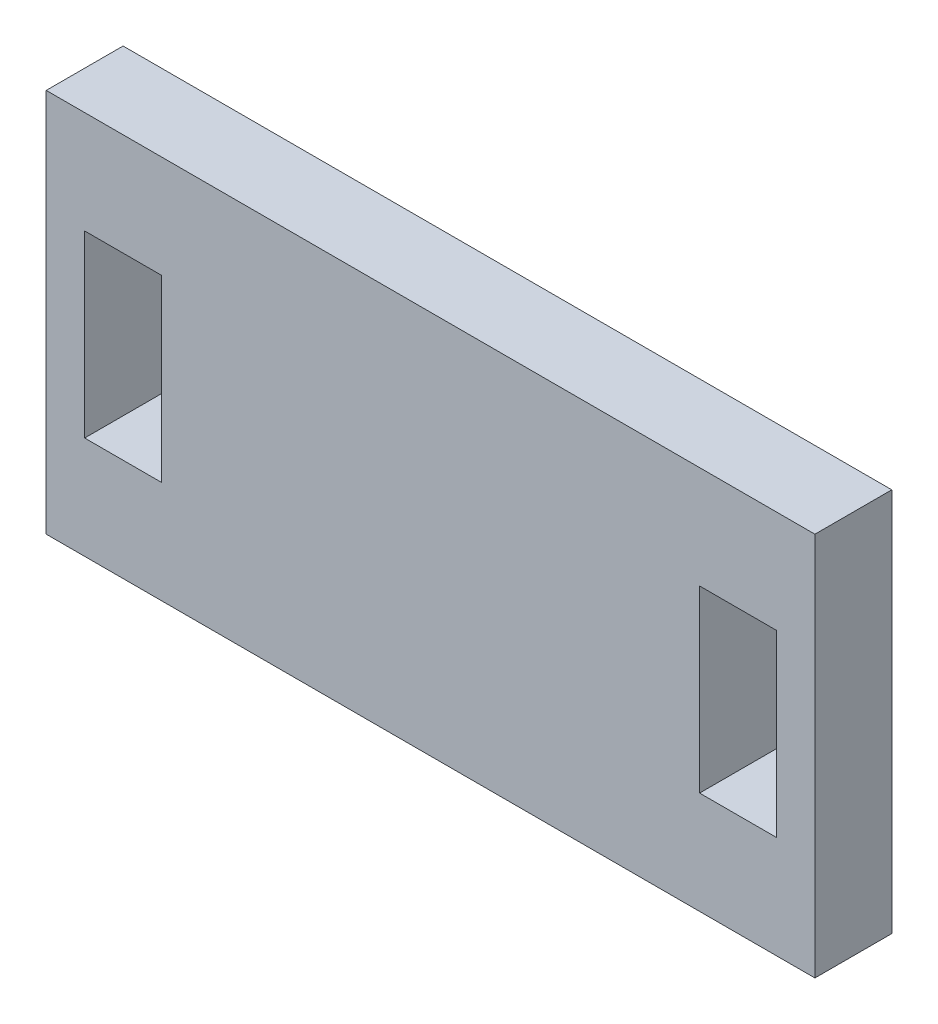
ISO-10303-21;
HEADER;
FILE_DESCRIPTION(('STEP AP214'),'2;1');
FILE_NAME('part.step','',(''),(''),'','','');
FILE_SCHEMA(('AUTOMOTIVE_DESIGN { 1 0 10303 214 1 1 1 1 }'));
ENDSEC;
DATA;
#1=APPLICATION_CONTEXT('core data for automotive mechanical design processes');
#2=APPLICATION_PROTOCOL_DEFINITION('international standard','automotive_design',2000,#1);
#3=PRODUCT_CONTEXT('',#1,'mechanical');
#4=PRODUCT('Part','Part','',(#3));
#5=PRODUCT_RELATED_PRODUCT_CATEGORY('part','',(#4));
#6=PRODUCT_DEFINITION_FORMATION('','',#4);
#7=PRODUCT_DEFINITION_CONTEXT('part definition',#1,'design');
#8=PRODUCT_DEFINITION('design','',#6,#7);
#9=PRODUCT_DEFINITION_SHAPE('','',#8);
#10=(LENGTH_UNIT() NAMED_UNIT(*) SI_UNIT(.MILLI.,.METRE.));
#11=(NAMED_UNIT(*) PLANE_ANGLE_UNIT() SI_UNIT($,.RADIAN.));
#12=(NAMED_UNIT(*) SI_UNIT($,.STERADIAN.) SOLID_ANGLE_UNIT());
#13=UNCERTAINTY_MEASURE_WITH_UNIT(LENGTH_MEASURE(1.E-05),#10,'distance_accuracy_value','');
#14=(GEOMETRIC_REPRESENTATION_CONTEXT(3) GLOBAL_UNCERTAINTY_ASSIGNED_CONTEXT((#13)) GLOBAL_UNIT_ASSIGNED_CONTEXT((#10,
#11,#12)) REPRESENTATION_CONTEXT('',''));
#15=CARTESIAN_POINT('',(0.,0.,0.));
#16=DIRECTION('',(0.,0.,1.));
#17=DIRECTION('',(1.,0.,0.));
#18=AXIS2_PLACEMENT_3D('',#15,#16,#17);
#19=CARTESIAN_POINT('',(0.,0.,1.5));
#20=DIRECTION('',(0.,0.,1.));
#21=DIRECTION('',(1.,0.,0.));
#22=AXIS2_PLACEMENT_3D('',#19,#20,#21);
#23=PLANE('',#22);
#24=DIRECTION('',(0.,1.,0.));
#25=VECTOR('',#24,1.);
#26=CARTESIAN_POINT('',(15.,7.5,1.5));
#27=LINE('',#26,#25);
#28=CARTESIAN_POINT('',(15.,-7.5,1.5));
#29=VERTEX_POINT('',#28);
#30=CARTESIAN_POINT('',(15.,7.5,1.5));
#31=VERTEX_POINT('',#30);
#32=EDGE_CURVE('E189',#29,#31,#27,.T.);
#33=ORIENTED_EDGE('',*,*,#32,.T.);
#34=DIRECTION('',(-1.,0.,0.));
#35=VECTOR('',#34,1.);
#36=CARTESIAN_POINT('',(-15.,7.5,1.5));
#37=LINE('',#36,#35);
#38=CARTESIAN_POINT('',(-15.,7.5,1.5));
#39=VERTEX_POINT('',#38);
#40=EDGE_CURVE('E192',#31,#39,#37,.T.);
#41=ORIENTED_EDGE('',*,*,#40,.T.);
#42=DIRECTION('',(0.,-1.,0.));
#43=VECTOR('',#42,1.);
#44=CARTESIAN_POINT('',(-15.,7.5,1.5));
#45=LINE('',#44,#43);
#46=CARTESIAN_POINT('',(-15.,-7.5,1.5));
#47=VERTEX_POINT('',#46);
#48=EDGE_CURVE('E195',#39,#47,#45,.T.);
#49=ORIENTED_EDGE('',*,*,#48,.T.);
#50=DIRECTION('',(1.,0.,0.));
#51=VECTOR('',#50,1.);
#52=CARTESIAN_POINT('',(-15.,-7.5,1.5));
#53=LINE('',#52,#51);
#54=EDGE_CURVE('E197',#47,#29,#53,.T.);
#55=ORIENTED_EDGE('',*,*,#54,.T.);
#56=EDGE_LOOP('',(#33,#41,#49,#55));
#57=FACE_BOUND('',#56,.T.);
#58=DIRECTION('',(1.,0.,0.));
#59=VECTOR('',#58,1.);
#60=CARTESIAN_POINT('',(-13.5,-3.5,1.5));
#61=LINE('',#60,#59);
#62=CARTESIAN_POINT('',(-13.5,-3.5,1.5));
#63=VERTEX_POINT('',#62);
#64=CARTESIAN_POINT('',(-10.5,-3.5,1.5));
#65=VERTEX_POINT('',#64);
#66=EDGE_CURVE('E160',#63,#65,#61,.T.);
#67=ORIENTED_EDGE('',*,*,#66,.F.);
#68=DIRECTION('',(0.,-1.,0.));
#69=VECTOR('',#68,1.);
#70=CARTESIAN_POINT('',(-13.5,3.5,1.5));
#71=LINE('',#70,#69);
#72=CARTESIAN_POINT('',(-13.5,3.5,1.5));
#73=VERTEX_POINT('',#72);
#74=EDGE_CURVE('E158',#73,#63,#71,.T.);
#75=ORIENTED_EDGE('',*,*,#74,.F.);
#76=DIRECTION('',(-1.,0.,0.));
#77=VECTOR('',#76,1.);
#78=CARTESIAN_POINT('',(-13.5,3.5,1.5));
#79=LINE('',#78,#77);
#80=CARTESIAN_POINT('',(-10.5,3.5,1.5));
#81=VERTEX_POINT('',#80);
#82=EDGE_CURVE('E166',#81,#73,#79,.T.);
#83=ORIENTED_EDGE('',*,*,#82,.F.);
#84=DIRECTION('',(0.,1.,0.));
#85=VECTOR('',#84,1.);
#86=CARTESIAN_POINT('',(-10.5,3.5,1.5));
#87=LINE('',#86,#85);
#88=EDGE_CURVE('E163',#65,#81,#87,.T.);
#89=ORIENTED_EDGE('',*,*,#88,.F.);
#90=EDGE_LOOP('',(#67,#75,#83,#89));
#91=FACE_BOUND('',#90,.T.);
#92=DIRECTION('',(1.,0.,0.));
#93=VECTOR('',#92,1.);
#94=CARTESIAN_POINT('',(10.5,-3.5,1.5));
#95=LINE('',#94,#93);
#96=CARTESIAN_POINT('',(10.5,-3.5,1.5));
#97=VERTEX_POINT('',#96);
#98=CARTESIAN_POINT('',(13.5,-3.5,1.5));
#99=VERTEX_POINT('',#98);
#100=EDGE_CURVE('E130',#97,#99,#95,.T.);
#101=ORIENTED_EDGE('',*,*,#100,.F.);
#102=DIRECTION('',(0.,-1.,0.));
#103=VECTOR('',#102,1.);
#104=CARTESIAN_POINT('',(10.5,3.5,1.5));
#105=LINE('',#104,#103);
#106=CARTESIAN_POINT('',(10.5,3.5,1.5));
#107=VERTEX_POINT('',#106);
#108=EDGE_CURVE('E122',#107,#97,#105,.T.);
#109=ORIENTED_EDGE('',*,*,#108,.F.);
#110=DIRECTION('',(-1.,0.,0.));
#111=VECTOR('',#110,1.);
#112=CARTESIAN_POINT('',(10.5,3.5,1.5));
#113=LINE('',#112,#111);
#114=CARTESIAN_POINT('',(13.5,3.5,1.5));
#115=VERTEX_POINT('',#114);
#116=EDGE_CURVE('E144',#115,#107,#113,.T.);
#117=ORIENTED_EDGE('',*,*,#116,.F.);
#118=DIRECTION('',(0.,1.,0.));
#119=VECTOR('',#118,1.);
#120=CARTESIAN_POINT('',(13.5,3.5,1.5));
#121=LINE('',#120,#119);
#122=EDGE_CURVE('E142',#99,#115,#121,.T.);
#123=ORIENTED_EDGE('',*,*,#122,.F.);
#124=EDGE_LOOP('',(#101,#109,#117,#123));
#125=FACE_BOUND('',#124,.T.);
#126=ADVANCED_FACE('F33',(#57,#91,#125),#23,.T.);
#127=CARTESIAN_POINT('',(0.,0.,-1.5));
#128=DIRECTION('',(0.,0.,1.));
#129=DIRECTION('',(1.,0.,0.));
#130=AXIS2_PLACEMENT_3D('',#127,#128,#129);
#131=PLANE('',#130);
#132=DIRECTION('',(0.,-1.,0.));
#133=VECTOR('',#132,1.);
#134=CARTESIAN_POINT('',(-13.5,3.5,-1.5));
#135=LINE('',#134,#133);
#136=CARTESIAN_POINT('',(-13.5,3.5,-1.5));
#137=VERTEX_POINT('',#136);
#138=CARTESIAN_POINT('',(-13.5,-3.5,-1.5));
#139=VERTEX_POINT('',#138);
#140=EDGE_CURVE('E138',#137,#139,#135,.T.);
#141=ORIENTED_EDGE('',*,*,#140,.T.);
#142=DIRECTION('',(1.,0.,0.));
#143=VECTOR('',#142,1.);
#144=CARTESIAN_POINT('',(-13.5,-3.5,-1.5));
#145=LINE('',#144,#143);
#146=CARTESIAN_POINT('',(-10.5,-3.5,-1.5));
#147=VERTEX_POINT('',#146);
#148=EDGE_CURVE('E171',#139,#147,#145,.T.);
#149=ORIENTED_EDGE('',*,*,#148,.T.);
#150=DIRECTION('',(0.,1.,0.));
#151=VECTOR('',#150,1.);
#152=CARTESIAN_POINT('',(-10.5,3.5,-1.5));
#153=LINE('',#152,#151);
#154=CARTESIAN_POINT('',(-10.5,3.5,-1.5));
#155=VERTEX_POINT('',#154);
#156=EDGE_CURVE('E174',#147,#155,#153,.T.);
#157=ORIENTED_EDGE('',*,*,#156,.T.);
#158=DIRECTION('',(-1.,0.,0.));
#159=VECTOR('',#158,1.);
#160=CARTESIAN_POINT('',(-13.5,3.5,-1.5));
#161=LINE('',#160,#159);
#162=EDGE_CURVE('E161',#155,#137,#161,.T.);
#163=ORIENTED_EDGE('',*,*,#162,.T.);
#164=EDGE_LOOP('',(#141,#149,#157,#163));
#165=FACE_BOUND('',#164,.T.);
#166=DIRECTION('',(0.,1.,0.));
#167=VECTOR('',#166,1.);
#168=CARTESIAN_POINT('',(15.,7.5,-1.5));
#169=LINE('',#168,#167);
#170=CARTESIAN_POINT('',(15.,-7.5,-1.5));
#171=VERTEX_POINT('',#170);
#172=CARTESIAN_POINT('',(15.,7.5,-1.5));
#173=VERTEX_POINT('',#172);
#174=EDGE_CURVE('E188',#171,#173,#169,.T.);
#175=ORIENTED_EDGE('',*,*,#174,.F.);
#176=DIRECTION('',(1.,0.,0.));
#177=VECTOR('',#176,1.);
#178=CARTESIAN_POINT('',(-15.,-7.5,-1.5));
#179=LINE('',#178,#177);
#180=CARTESIAN_POINT('',(-15.,-7.5,-1.5));
#181=VERTEX_POINT('',#180);
#182=EDGE_CURVE('E193',#181,#171,#179,.T.);
#183=ORIENTED_EDGE('',*,*,#182,.F.);
#184=DIRECTION('',(0.,-1.,0.));
#185=VECTOR('',#184,1.);
#186=CARTESIAN_POINT('',(-15.,7.5,-1.5));
#187=LINE('',#186,#185);
#188=CARTESIAN_POINT('',(-15.,7.5,-1.5));
#189=VERTEX_POINT('',#188);
#190=EDGE_CURVE('E204',#189,#181,#187,.T.);
#191=ORIENTED_EDGE('',*,*,#190,.F.);
#192=DIRECTION('',(-1.,0.,0.));
#193=VECTOR('',#192,1.);
#194=CARTESIAN_POINT('',(-15.,7.5,-1.5));
#195=LINE('',#194,#193);
#196=EDGE_CURVE('E202',#173,#189,#195,.T.);
#197=ORIENTED_EDGE('',*,*,#196,.F.);
#198=EDGE_LOOP('',(#175,#183,#191,#197));
#199=FACE_BOUND('',#198,.T.);
#200=DIRECTION('',(0.,-1.,0.));
#201=VECTOR('',#200,1.);
#202=CARTESIAN_POINT('',(10.5,3.5,-1.5));
#203=LINE('',#202,#201);
#204=CARTESIAN_POINT('',(10.5,3.5,-1.5));
#205=VERTEX_POINT('',#204);
#206=CARTESIAN_POINT('',(10.5,-3.5,-1.5));
#207=VERTEX_POINT('',#206);
#208=EDGE_CURVE('E56',#205,#207,#203,.T.);
#209=ORIENTED_EDGE('',*,*,#208,.T.);
#210=DIRECTION('',(1.,0.,0.));
#211=VECTOR('',#210,1.);
#212=CARTESIAN_POINT('',(10.5,-3.5,-1.5));
#213=LINE('',#212,#211);
#214=CARTESIAN_POINT('',(13.5,-3.5,-1.5));
#215=VERTEX_POINT('',#214);
#216=EDGE_CURVE('E137',#207,#215,#213,.T.);
#217=ORIENTED_EDGE('',*,*,#216,.T.);
#218=DIRECTION('',(0.,1.,0.));
#219=VECTOR('',#218,1.);
#220=CARTESIAN_POINT('',(13.5,3.5,-1.5));
#221=LINE('',#220,#219);
#222=CARTESIAN_POINT('',(13.5,3.5,-1.5));
#223=VERTEX_POINT('',#222);
#224=EDGE_CURVE('E150',#215,#223,#221,.T.);
#225=ORIENTED_EDGE('',*,*,#224,.T.);
#226=DIRECTION('',(-1.,0.,0.));
#227=VECTOR('',#226,1.);
#228=CARTESIAN_POINT('',(10.5,3.5,-1.5));
#229=LINE('',#228,#227);
#230=EDGE_CURVE('E131',#223,#205,#229,.T.);
#231=ORIENTED_EDGE('',*,*,#230,.T.);
#232=EDGE_LOOP('',(#209,#217,#225,#231));
#233=FACE_BOUND('',#232,.T.);
#234=ADVANCED_FACE('F222',(#165,#199,#233),#131,.F.);
#235=CARTESIAN_POINT('',(15.,7.5,1.5));
#236=DIRECTION('',(-1.,0.,0.));
#237=DIRECTION('',(0.,-1.,0.));
#238=AXIS2_PLACEMENT_3D('',#235,#236,#237);
#239=PLANE('',#238);
#240=ORIENTED_EDGE('',*,*,#174,.T.);
#241=DIRECTION('',(0.,0.,-1.));
#242=VECTOR('',#241,1.);
#243=CARTESIAN_POINT('',(15.,7.5,1.5));
#244=LINE('',#243,#242);
#245=EDGE_CURVE('E11',#31,#173,#244,.T.);
#246=ORIENTED_EDGE('',*,*,#245,.F.);
#247=ORIENTED_EDGE('',*,*,#32,.F.);
#248=DIRECTION('',(0.,0.,-1.));
#249=VECTOR('',#248,1.);
#250=CARTESIAN_POINT('',(15.,-7.5,1.5));
#251=LINE('',#250,#249);
#252=EDGE_CURVE('E199',#29,#171,#251,.T.);
#253=ORIENTED_EDGE('',*,*,#252,.T.);
#254=EDGE_LOOP('',(#240,#246,#247,#253));
#255=FACE_BOUND('',#254,.T.);
#256=ADVANCED_FACE('F35',(#255),#239,.F.);
#257=CARTESIAN_POINT('',(-15.,7.5,1.5));
#258=DIRECTION('',(0.,-1.,0.));
#259=DIRECTION('',(0.,0.,-1.));
#260=AXIS2_PLACEMENT_3D('',#257,#258,#259);
#261=PLANE('',#260);
#262=ORIENTED_EDGE('',*,*,#196,.T.);
#263=DIRECTION('',(0.,0.,-1.));
#264=VECTOR('',#263,1.);
#265=CARTESIAN_POINT('',(-15.,7.5,1.5));
#266=LINE('',#265,#264);
#267=EDGE_CURVE('E41',#39,#189,#266,.T.);
#268=ORIENTED_EDGE('',*,*,#267,.F.);
#269=ORIENTED_EDGE('',*,*,#40,.F.);
#270=ORIENTED_EDGE('',*,*,#245,.T.);
#271=EDGE_LOOP('',(#262,#268,#269,#270));
#272=FACE_BOUND('',#271,.T.);
#273=ADVANCED_FACE('F233',(#272),#261,.F.);
#274=CARTESIAN_POINT('',(-15.,7.5,1.5));
#275=DIRECTION('',(1.,0.,0.));
#276=DIRECTION('',(0.,1.,0.));
#277=AXIS2_PLACEMENT_3D('',#274,#275,#276);
#278=PLANE('',#277);
#279=ORIENTED_EDGE('',*,*,#190,.T.);
#280=DIRECTION('',(0.,0.,-1.));
#281=VECTOR('',#280,1.);
#282=CARTESIAN_POINT('',(-15.,-7.5,1.5));
#283=LINE('',#282,#281);
#284=EDGE_CURVE('E209',#47,#181,#283,.T.);
#285=ORIENTED_EDGE('',*,*,#284,.F.);
#286=ORIENTED_EDGE('',*,*,#48,.F.);
#287=ORIENTED_EDGE('',*,*,#267,.T.);
#288=EDGE_LOOP('',(#279,#285,#286,#287));
#289=FACE_BOUND('',#288,.T.);
#290=ADVANCED_FACE('F216',(#289),#278,.F.);
#291=CARTESIAN_POINT('',(-15.,-7.5,1.5));
#292=DIRECTION('',(0.,1.,0.));
#293=DIRECTION('',(0.,0.,1.));
#294=AXIS2_PLACEMENT_3D('',#291,#292,#293);
#295=PLANE('',#294);
#296=ORIENTED_EDGE('',*,*,#182,.T.);
#297=ORIENTED_EDGE('',*,*,#252,.F.);
#298=ORIENTED_EDGE('',*,*,#54,.F.);
#299=ORIENTED_EDGE('',*,*,#284,.T.);
#300=EDGE_LOOP('',(#296,#297,#298,#299));
#301=FACE_BOUND('',#300,.T.);
#302=ADVANCED_FACE('F226',(#301),#295,.F.);
#303=CARTESIAN_POINT('',(-13.5,3.5,1.5));
#304=DIRECTION('',(1.,0.,0.));
#305=DIRECTION('',(0.,1.,0.));
#306=AXIS2_PLACEMENT_3D('',#303,#304,#305);
#307=PLANE('',#306);
#308=ORIENTED_EDGE('',*,*,#140,.F.);
#309=DIRECTION('',(0.,0.,-1.));
#310=VECTOR('',#309,1.);
#311=CARTESIAN_POINT('',(-13.5,3.5,1.5));
#312=LINE('',#311,#310);
#313=EDGE_CURVE('E168',#73,#137,#312,.T.);
#314=ORIENTED_EDGE('',*,*,#313,.F.);
#315=ORIENTED_EDGE('',*,*,#74,.T.);
#316=DIRECTION('',(0.,0.,-1.));
#317=VECTOR('',#316,1.);
#318=CARTESIAN_POINT('',(-13.5,-3.5,1.5));
#319=LINE('',#318,#317);
#320=EDGE_CURVE('E185',#63,#139,#319,.T.);
#321=ORIENTED_EDGE('',*,*,#320,.T.);
#322=EDGE_LOOP('',(#308,#314,#315,#321));
#323=FACE_BOUND('',#322,.T.);
#324=ADVANCED_FACE('F248',(#323),#307,.T.);
#325=CARTESIAN_POINT('',(-13.5,-3.5,1.5));
#326=DIRECTION('',(0.,1.,0.));
#327=DIRECTION('',(0.,0.,1.));
#328=AXIS2_PLACEMENT_3D('',#325,#326,#327);
#329=PLANE('',#328);
#330=ORIENTED_EDGE('',*,*,#148,.F.);
#331=ORIENTED_EDGE('',*,*,#320,.F.);
#332=ORIENTED_EDGE('',*,*,#66,.T.);
#333=DIRECTION('',(0.,0.,-1.));
#334=VECTOR('',#333,1.);
#335=CARTESIAN_POINT('',(-10.5,-3.5,1.5));
#336=LINE('',#335,#334);
#337=EDGE_CURVE('E183',#65,#147,#336,.T.);
#338=ORIENTED_EDGE('',*,*,#337,.T.);
#339=EDGE_LOOP('',(#330,#331,#332,#338));
#340=FACE_BOUND('',#339,.T.);
#341=ADVANCED_FACE('F255',(#340),#329,.T.);
#342=CARTESIAN_POINT('',(-10.5,3.5,1.5));
#343=DIRECTION('',(-1.,0.,0.));
#344=DIRECTION('',(0.,0.,1.));
#345=AXIS2_PLACEMENT_3D('',#342,#343,#344);
#346=PLANE('',#345);
#347=ORIENTED_EDGE('',*,*,#156,.F.);
#348=ORIENTED_EDGE('',*,*,#337,.F.);
#349=ORIENTED_EDGE('',*,*,#88,.T.);
#350=DIRECTION('',(0.,0.,-1.));
#351=VECTOR('',#350,1.);
#352=CARTESIAN_POINT('',(-10.5,3.5,1.5));
#353=LINE('',#352,#351);
#354=EDGE_CURVE('E181',#81,#155,#353,.T.);
#355=ORIENTED_EDGE('',*,*,#354,.T.);
#356=EDGE_LOOP('',(#347,#348,#349,#355));
#357=FACE_BOUND('',#356,.T.);
#358=ADVANCED_FACE('F260',(#357),#346,.T.);
#359=CARTESIAN_POINT('',(-13.5,3.5,1.5));
#360=DIRECTION('',(0.,-1.,0.));
#361=DIRECTION('',(0.,0.,-1.));
#362=AXIS2_PLACEMENT_3D('',#359,#360,#361);
#363=PLANE('',#362);
#364=ORIENTED_EDGE('',*,*,#162,.F.);
#365=ORIENTED_EDGE('',*,*,#354,.F.);
#366=ORIENTED_EDGE('',*,*,#82,.T.);
#367=ORIENTED_EDGE('',*,*,#313,.T.);
#368=EDGE_LOOP('',(#364,#365,#366,#367));
#369=FACE_BOUND('',#368,.T.);
#370=ADVANCED_FACE('F267',(#369),#363,.T.);
#371=CARTESIAN_POINT('',(10.5,3.5,1.5));
#372=DIRECTION('',(1.,0.,0.));
#373=DIRECTION('',(0.,1.,0.));
#374=AXIS2_PLACEMENT_3D('',#371,#372,#373);
#375=PLANE('',#374);
#376=ORIENTED_EDGE('',*,*,#208,.F.);
#377=DIRECTION('',(0.,0.,-1.));
#378=VECTOR('',#377,1.);
#379=CARTESIAN_POINT('',(10.5,3.5,1.5));
#380=LINE('',#379,#378);
#381=EDGE_CURVE('E126',#107,#205,#380,.T.);
#382=ORIENTED_EDGE('',*,*,#381,.F.);
#383=ORIENTED_EDGE('',*,*,#108,.T.);
#384=DIRECTION('',(0.,0.,-1.));
#385=VECTOR('',#384,1.);
#386=CARTESIAN_POINT('',(10.5,-3.5,1.5));
#387=LINE('',#386,#385);
#388=EDGE_CURVE('E125',#97,#207,#387,.T.);
#389=ORIENTED_EDGE('',*,*,#388,.T.);
#390=EDGE_LOOP('',(#376,#382,#383,#389));
#391=FACE_BOUND('',#390,.T.);
#392=ADVANCED_FACE('F124',(#391),#375,.T.);
#393=CARTESIAN_POINT('',(10.5,-3.5,1.5));
#394=DIRECTION('',(0.,1.,0.));
#395=DIRECTION('',(0.,0.,1.));
#396=AXIS2_PLACEMENT_3D('',#393,#394,#395);
#397=PLANE('',#396);
#398=ORIENTED_EDGE('',*,*,#216,.F.);
#399=ORIENTED_EDGE('',*,*,#388,.F.);
#400=ORIENTED_EDGE('',*,*,#100,.T.);
#401=DIRECTION('',(0.,0.,-1.));
#402=VECTOR('',#401,1.);
#403=CARTESIAN_POINT('',(13.5,-3.5,1.5));
#404=LINE('',#403,#402);
#405=EDGE_CURVE('E139',#99,#215,#404,.T.);
#406=ORIENTED_EDGE('',*,*,#405,.T.);
#407=EDGE_LOOP('',(#398,#399,#400,#406));
#408=FACE_BOUND('',#407,.T.);
#409=ADVANCED_FACE('F134',(#408),#397,.T.);
#410=CARTESIAN_POINT('',(13.5,3.5,1.5));
#411=DIRECTION('',(-1.,0.,0.));
#412=DIRECTION('',(0.,-1.,0.));
#413=AXIS2_PLACEMENT_3D('',#410,#411,#412);
#414=PLANE('',#413);
#415=ORIENTED_EDGE('',*,*,#224,.F.);
#416=ORIENTED_EDGE('',*,*,#405,.F.);
#417=ORIENTED_EDGE('',*,*,#122,.T.);
#418=DIRECTION('',(0.,0.,-1.));
#419=VECTOR('',#418,1.);
#420=CARTESIAN_POINT('',(13.5,3.5,1.5));
#421=LINE('',#420,#419);
#422=EDGE_CURVE('E48',#115,#223,#421,.T.);
#423=ORIENTED_EDGE('',*,*,#422,.T.);
#424=EDGE_LOOP('',(#415,#416,#417,#423));
#425=FACE_BOUND('',#424,.T.);
#426=ADVANCED_FACE('F285',(#425),#414,.T.);
#427=CARTESIAN_POINT('',(10.5,3.5,1.5));
#428=DIRECTION('',(0.,-1.,0.));
#429=DIRECTION('',(0.,0.,-1.));
#430=AXIS2_PLACEMENT_3D('',#427,#428,#429);
#431=PLANE('',#430);
#432=ORIENTED_EDGE('',*,*,#230,.F.);
#433=ORIENTED_EDGE('',*,*,#422,.F.);
#434=ORIENTED_EDGE('',*,*,#116,.T.);
#435=ORIENTED_EDGE('',*,*,#381,.T.);
#436=EDGE_LOOP('',(#432,#433,#434,#435));
#437=FACE_BOUND('',#436,.T.);
#438=ADVANCED_FACE('F288',(#437),#431,.T.);
#439=CLOSED_SHELL('',(#126,#234,#256,#273,#290,#302,#324,#341,#358,#370,#392,#409,#426,#438));
#440=MANIFOLD_SOLID_BREP('B2',#439);
#441=ADVANCED_BREP_SHAPE_REPRESENTATION('',(#18,#440),#14);
#442=SHAPE_DEFINITION_REPRESENTATION(#9,#441);
ENDSEC;
END-ISO-10303-21;
